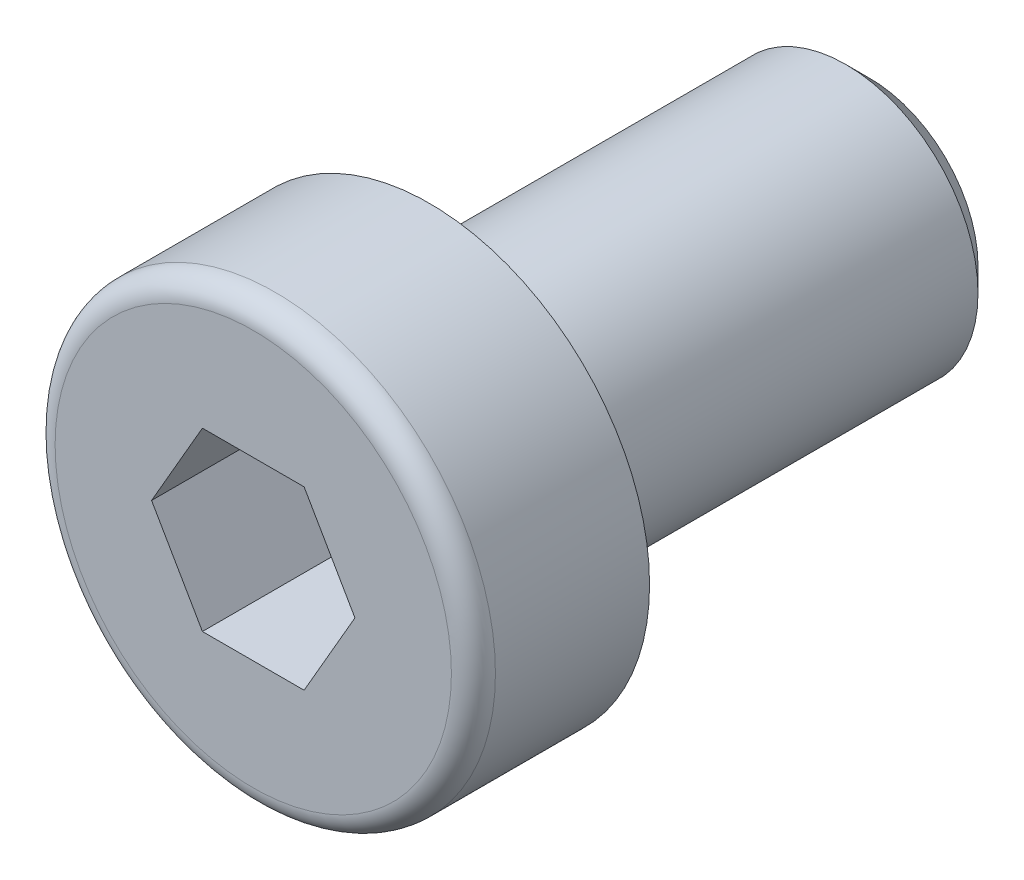
ISO-10303-21;
HEADER;
FILE_DESCRIPTION(('STEP AP214'),'2;1');
FILE_NAME('part.step','',(''),(''),'','','');
FILE_SCHEMA(('AUTOMOTIVE_DESIGN { 1 0 10303 214 1 1 1 1 }'));
ENDSEC;
DATA;
#1=APPLICATION_CONTEXT('core data for automotive mechanical design processes');
#2=APPLICATION_PROTOCOL_DEFINITION('international standard','automotive_design',2000,#1);
#3=PRODUCT_CONTEXT('',#1,'mechanical');
#4=PRODUCT('Part','Part','',(#3));
#5=PRODUCT_RELATED_PRODUCT_CATEGORY('part','',(#4));
#6=PRODUCT_DEFINITION_FORMATION('','',#4);
#7=PRODUCT_DEFINITION_CONTEXT('part definition',#1,'design');
#8=PRODUCT_DEFINITION('design','',#6,#7);
#9=PRODUCT_DEFINITION_SHAPE('','',#8);
#10=(LENGTH_UNIT() NAMED_UNIT(*) SI_UNIT(.MILLI.,.METRE.));
#11=(NAMED_UNIT(*) PLANE_ANGLE_UNIT() SI_UNIT($,.RADIAN.));
#12=(NAMED_UNIT(*) SI_UNIT($,.STERADIAN.) SOLID_ANGLE_UNIT());
#13=UNCERTAINTY_MEASURE_WITH_UNIT(LENGTH_MEASURE(1.E-05),#10,'distance_accuracy_value','');
#14=(GEOMETRIC_REPRESENTATION_CONTEXT(3) GLOBAL_UNCERTAINTY_ASSIGNED_CONTEXT((#13)) GLOBAL_UNIT_ASSIGNED_CONTEXT((#10,
#11,#12)) REPRESENTATION_CONTEXT('',''));
#15=CARTESIAN_POINT('',(0.,0.,0.));
#16=DIRECTION('',(0.,0.,1.));
#17=DIRECTION('',(1.,0.,0.));
#18=AXIS2_PLACEMENT_3D('',#15,#16,#17);
#19=CARTESIAN_POINT('',(0.,0.,4.));
#20=DIRECTION('',(0.,0.,1.));
#21=DIRECTION('',(1.,0.,0.));
#22=AXIS2_PLACEMENT_3D('',#19,#20,#21);
#23=CYLINDRICAL_SURFACE('',#22,3.);
#24=CARTESIAN_POINT('',(0.,0.,-0.3));
#25=DIRECTION('',(0.,0.,1.));
#26=DIRECTION('',(1.,0.,0.));
#27=AXIS2_PLACEMENT_3D('',#24,#25,#26);
#28=CIRCLE('',#27,3.);
#29=CARTESIAN_POINT('',(3.,0.,-0.3));
#30=VERTEX_POINT('',#29);
#31=EDGE_CURVE('E135',#30,#30,#28,.T.);
#32=ORIENTED_EDGE('',*,*,#31,.F.);
#33=EDGE_LOOP('',(#32));
#34=FACE_BOUND('',#33,.T.);
#35=CARTESIAN_POINT('',(0.,0.,-0.305));
#36=DIRECTION('',(0.,0.,1.));
#37=DIRECTION('',(1.,0.,0.));
#38=AXIS2_PLACEMENT_3D('',#35,#36,#37);
#39=CIRCLE('',#38,3.);
#40=CARTESIAN_POINT('',(3.,0.,-0.305));
#41=VERTEX_POINT('',#40);
#42=EDGE_CURVE('E284',#41,#41,#39,.T.);
#43=ORIENTED_EDGE('',*,*,#42,.T.);
#44=EDGE_LOOP('',(#43));
#45=FACE_BOUND('',#44,.T.);
#46=ADVANCED_FACE('F16',(#34,#45),#23,.T.);
#47=CARTESIAN_POINT('',(0.,0.,4.));
#48=DIRECTION('',(0.,0.,1.));
#49=DIRECTION('',(1.,0.,0.));
#50=AXIS2_PLACEMENT_3D('',#47,#48,#49);
#51=PLANE('',#50);
#52=CARTESIAN_POINT('',(0.,0.,4.));
#53=DIRECTION('',(0.,0.,1.));
#54=DIRECTION('',(1.,0.,0.));
#55=AXIS2_PLACEMENT_3D('',#52,#53,#54);
#56=CIRCLE('',#55,4.5);
#57=CARTESIAN_POINT('',(4.5,0.,4.));
#58=VERTEX_POINT('',#57);
#59=EDGE_CURVE('E119',#58,#58,#56,.T.);
#60=ORIENTED_EDGE('',*,*,#59,.T.);
#61=EDGE_LOOP('',(#60));
#62=FACE_BOUND('',#61,.T.);
#63=DIRECTION('',(1.,0.,0.));
#64=VECTOR('',#63,1.);
#65=CARTESIAN_POINT('',(-1.1547,1.99999906749978,4.));
#66=LINE('',#65,#64);
#67=CARTESIAN_POINT('',(-1.1547,1.99999906749978,4.));
#68=VERTEX_POINT('',#67);
#69=CARTESIAN_POINT('',(1.1547,1.99999906749978,4.));
#70=VERTEX_POINT('',#69);
#71=EDGE_CURVE('E96',#68,#70,#66,.T.);
#72=ORIENTED_EDGE('',*,*,#71,.T.);
#73=DIRECTION('',(0.5,-0.866025403784439,0.));
#74=VECTOR('',#73,1.);
#75=CARTESIAN_POINT('',(1.1547,1.99999906749978,4.));
#76=LINE('',#75,#74);
#77=CARTESIAN_POINT('',(2.3094,0.,4.));
#78=VERTEX_POINT('',#77);
#79=EDGE_CURVE('E32',#70,#78,#76,.T.);
#80=ORIENTED_EDGE('',*,*,#79,.T.);
#81=DIRECTION('',(-0.5,-0.866025403784439,0.));
#82=VECTOR('',#81,1.);
#83=CARTESIAN_POINT('',(2.3094,0.,4.));
#84=LINE('',#83,#82);
#85=CARTESIAN_POINT('',(1.1547,-1.99999906749978,4.));
#86=VERTEX_POINT('',#85);
#87=EDGE_CURVE('E200',#78,#86,#84,.T.);
#88=ORIENTED_EDGE('',*,*,#87,.T.);
#89=DIRECTION('',(-1.,0.,0.));
#90=VECTOR('',#89,1.);
#91=CARTESIAN_POINT('',(1.1547,-1.99999906749978,4.));
#92=LINE('',#91,#90);
#93=CARTESIAN_POINT('',(-1.1547,-1.99999906749978,4.));
#94=VERTEX_POINT('',#93);
#95=EDGE_CURVE('E259',#86,#94,#92,.T.);
#96=ORIENTED_EDGE('',*,*,#95,.T.);
#97=DIRECTION('',(-0.5,0.866025403784439,0.));
#98=VECTOR('',#97,1.);
#99=CARTESIAN_POINT('',(-1.1547,-1.99999906749978,4.));
#100=LINE('',#99,#98);
#101=CARTESIAN_POINT('',(-2.3094,0.,4.));
#102=VERTEX_POINT('',#101);
#103=EDGE_CURVE('E253',#94,#102,#100,.T.);
#104=ORIENTED_EDGE('',*,*,#103,.T.);
#105=DIRECTION('',(0.5,0.866025403784439,0.));
#106=VECTOR('',#105,1.);
#107=CARTESIAN_POINT('',(-2.3094,0.,4.));
#108=LINE('',#107,#106);
#109=EDGE_CURVE('E105',#102,#68,#108,.T.);
#110=ORIENTED_EDGE('',*,*,#109,.T.);
#111=EDGE_LOOP('',(#72,#80,#88,#96,#104,#110));
#112=FACE_BOUND('',#111,.T.);
#113=ADVANCED_FACE('F159',(#62,#112),#51,.T.);
#114=CARTESIAN_POINT('',(0.,0.,-0.3));
#115=DIRECTION('',(0.,0.,1.));
#116=DIRECTION('',(1.,0.,0.));
#117=AXIS2_PLACEMENT_3D('',#114,#115,#116);
#118=TOROIDAL_SURFACE('',#117,3.3,0.3);
#119=ORIENTED_EDGE('',*,*,#31,.T.);
#120=EDGE_LOOP('',(#119));
#121=FACE_BOUND('',#120,.T.);
#122=CARTESIAN_POINT('',(0.,0.,0.));
#123=DIRECTION('',(0.,0.,1.));
#124=DIRECTION('',(1.,0.,0.));
#125=AXIS2_PLACEMENT_3D('',#122,#123,#124);
#126=CIRCLE('',#125,3.3);
#127=CARTESIAN_POINT('',(3.3,0.,0.));
#128=VERTEX_POINT('',#127);
#129=EDGE_CURVE('E131',#128,#128,#126,.T.);
#130=ORIENTED_EDGE('',*,*,#129,.F.);
#131=EDGE_LOOP('',(#130));
#132=FACE_BOUND('',#131,.T.);
#133=ADVANCED_FACE('F164',(#121,#132),#118,.F.);
#134=CARTESIAN_POINT('',(0.,5.,0.));
#135=DIRECTION('',(0.,0.,-1.));
#136=DIRECTION('',(-1.,0.,0.));
#137=AXIS2_PLACEMENT_3D('',#134,#135,#136);
#138=PLANE('',#137);
#139=ORIENTED_EDGE('',*,*,#129,.T.);
#140=EDGE_LOOP('',(#139));
#141=FACE_BOUND('',#140,.T.);
#142=CARTESIAN_POINT('',(0.,0.,0.));
#143=DIRECTION('',(0.,0.,1.));
#144=DIRECTION('',(1.,0.,0.));
#145=AXIS2_PLACEMENT_3D('',#142,#143,#144);
#146=CIRCLE('',#145,5.);
#147=CARTESIAN_POINT('',(5.,0.,0.));
#148=VERTEX_POINT('',#147);
#149=EDGE_CURVE('E127',#148,#148,#146,.T.);
#150=ORIENTED_EDGE('',*,*,#149,.F.);
#151=EDGE_LOOP('',(#150));
#152=FACE_BOUND('',#151,.T.);
#153=ADVANCED_FACE('F172',(#141,#152),#138,.T.);
#154=CARTESIAN_POINT('',(0.,0.,4.));
#155=DIRECTION('',(0.,0.,1.));
#156=DIRECTION('',(1.,0.,0.));
#157=AXIS2_PLACEMENT_3D('',#154,#155,#156);
#158=CYLINDRICAL_SURFACE('',#157,5.);
#159=ORIENTED_EDGE('',*,*,#149,.T.);
#160=EDGE_LOOP('',(#159));
#161=FACE_BOUND('',#160,.T.);
#162=CARTESIAN_POINT('',(0.,0.,3.5));
#163=DIRECTION('',(0.,0.,1.));
#164=DIRECTION('',(1.,0.,0.));
#165=AXIS2_PLACEMENT_3D('',#162,#163,#164);
#166=CIRCLE('',#165,5.);
#167=CARTESIAN_POINT('',(5.,0.,3.5));
#168=VERTEX_POINT('',#167);
#169=EDGE_CURVE('E123',#168,#168,#166,.T.);
#170=ORIENTED_EDGE('',*,*,#169,.F.);
#171=EDGE_LOOP('',(#170));
#172=FACE_BOUND('',#171,.T.);
#173=ADVANCED_FACE('F176',(#161,#172),#158,.T.);
#174=CARTESIAN_POINT('',(0.,0.,3.5));
#175=DIRECTION('',(0.,0.,1.));
#176=DIRECTION('',(1.,0.,0.));
#177=AXIS2_PLACEMENT_3D('',#174,#175,#176);
#178=TOROIDAL_SURFACE('',#177,4.5,0.5);
#179=ORIENTED_EDGE('',*,*,#59,.F.);
#180=EDGE_LOOP('',(#179));
#181=FACE_BOUND('',#180,.T.);
#182=ORIENTED_EDGE('',*,*,#169,.T.);
#183=EDGE_LOOP('',(#182));
#184=FACE_BOUND('',#183,.T.);
#185=ADVANCED_FACE('F180',(#181,#184),#178,.T.);
#186=CARTESIAN_POINT('',(1.1547,1.99999906749978,-0.333332711666522));
#187=DIRECTION('',(-0.866025403784438,-0.5,0.));
#188=DIRECTION('',(-0.5,0.866025403784439,0.));
#189=AXIS2_PLACEMENT_3D('',#186,#187,#188);
#190=PLANE('',#189);
#191=DIRECTION('',(0.,0.,1.));
#192=VECTOR('',#191,1.);
#193=CARTESIAN_POINT('',(2.3094,0.,-0.333332711666522));
#194=LINE('',#193,#192);
#195=CARTESIAN_POINT('',(2.3094,0.,1.));
#196=VERTEX_POINT('',#195);
#197=EDGE_CURVE('E117',#196,#78,#194,.T.);
#198=ORIENTED_EDGE('',*,*,#197,.T.);
#199=ORIENTED_EDGE('',*,*,#79,.F.);
#200=DIRECTION('',(0.,0.,1.));
#201=VECTOR('',#200,1.);
#202=CARTESIAN_POINT('',(1.1547,1.99999906749978,-0.333332711666522));
#203=LINE('',#202,#201);
#204=CARTESIAN_POINT('',(1.1547,1.99999906749978,1.));
#205=VERTEX_POINT('',#204);
#206=EDGE_CURVE('E89',#205,#70,#203,.T.);
#207=ORIENTED_EDGE('',*,*,#206,.F.);
#208=CARTESIAN_POINT('',(2.30940115470054,-2.E-06,1.00000066666717));
#209=CARTESIAN_POINT('',(2.2586590633301,0.087885880335907,0.9706961706999));
#210=CARTESIAN_POINT('',(2.20747896699173,0.176532407530229,0.944045256937717));
#211=CARTESIAN_POINT('',(2.10423262359364,0.355360319991423,0.897526868213209));
#212=CARTESIAN_POINT('',(2.05216454263161,0.445544881670276,0.877675847930465));
#213=CARTESIAN_POINT('',(1.94867363491875,0.624796391950367,0.846776277435701));
#214=CARTESIAN_POINT('',(1.8972667271894,0.713835767997602,0.835522049923352));
#215=CARTESIAN_POINT('',(1.79421114915164,0.892333265162389,0.822089318026336));
#216=CARTESIAN_POINT('',(1.74256285316985,0.981790737927202,0.819899687557668));
#217=CARTESIAN_POINT('',(1.64606340062569,1.14893269263626,0.824466291009913));
#218=CARTESIAN_POINT('',(1.60119776416565,1.22664225449897,0.83010127235949));
#219=CARTESIAN_POINT('',(1.51175877649126,1.38155512532854,0.847957309601284));
#220=CARTESIAN_POINT('',(1.46718573439589,1.45875789888563,0.860184459220009));
#221=CARTESIAN_POINT('',(1.37756249119973,1.61398990964047,0.890749992357217));
#222=CARTESIAN_POINT('',(1.33252362751513,1.69199950985737,0.909217881832975));
#223=CARTESIAN_POINT('',(1.2431174638359,1.84685552785963,0.951132193219494));
#224=CARTESIAN_POINT('',(1.19874901931202,1.92370392802778,0.974568773138314));
#225=CARTESIAN_POINT('',(1.15469884529946,2.00000106749979,1.00000066666717));
#226=B_SPLINE_CURVE_WITH_KNOTS('',3,(#208,#209,#210,#211,#212,#213,#214,#215,#216,#217,#218,
#219,#220,#221,#222,#223,#224,#225),.UNSPECIFIED.,.F.,.F.,(4,2,2,2,2,2,2,2,4),(0.,
0.317016021868474,0.63479384162528,0.944707629264745,1.2542409089752,1.52370869907371,
1.79342601033586,2.06912439061208,2.34428168581533),.UNSPECIFIED.);
#227=EDGE_CURVE('E81',#196,#205,#226,.T.);
#228=ORIENTED_EDGE('',*,*,#227,.F.);
#229=EDGE_LOOP('',(#198,#199,#207,#228));
#230=FACE_BOUND('',#229,.T.);
#231=ADVANCED_FACE('F90',(#230),#190,.T.);
#232=CARTESIAN_POINT('',(2.3094,0.,-0.333332711666522));
#233=DIRECTION('',(-0.866025403784439,0.5,0.));
#234=DIRECTION('',(0.5,0.866025403784439,0.));
#235=AXIS2_PLACEMENT_3D('',#232,#233,#234);
#236=PLANE('',#235);
#237=DIRECTION('',(0.,0.,1.));
#238=VECTOR('',#237,1.);
#239=CARTESIAN_POINT('',(1.1547,-1.99999906749978,-0.333332711666522));
#240=LINE('',#239,#238);
#241=CARTESIAN_POINT('',(1.1547,-1.99999906749978,1.));
#242=VERTEX_POINT('',#241);
#243=EDGE_CURVE('E114',#242,#86,#240,.T.);
#244=ORIENTED_EDGE('',*,*,#243,.T.);
#245=ORIENTED_EDGE('',*,*,#87,.F.);
#246=ORIENTED_EDGE('',*,*,#197,.F.);
#247=CARTESIAN_POINT('',(1.15469884529946,-2.00000106749979,1.00000066666717));
#248=CARTESIAN_POINT('',(1.2054409366699,-1.91211318716388,0.970696170699899));
#249=CARTESIAN_POINT('',(1.25662103300827,-1.82346665996956,0.944045256937716));
#250=CARTESIAN_POINT('',(1.35986737640636,-1.64463874750836,0.897526868213209));
#251=CARTESIAN_POINT('',(1.41193545736839,-1.55445418582951,0.877675847930465));
#252=CARTESIAN_POINT('',(1.51542636508125,-1.37520267554942,0.8467762774357));
#253=CARTESIAN_POINT('',(1.5668332728106,-1.28616329950218,0.835522049923351));
#254=CARTESIAN_POINT('',(1.66988885084836,-1.10766580233739,0.822089318026335));
#255=CARTESIAN_POINT('',(1.72153714683015,-1.01820832957258,0.819899687557668));
#256=CARTESIAN_POINT('',(1.81803659937431,-0.851066374863522,0.824466291009913));
#257=CARTESIAN_POINT('',(1.86290223583435,-0.773356813000813,0.83010127235949));
#258=CARTESIAN_POINT('',(1.95234122350874,-0.618443942171244,0.847957309601284));
#259=CARTESIAN_POINT('',(1.99691426560411,-0.54124116861415,0.860184459220008));
#260=CARTESIAN_POINT('',(2.08653750880027,-0.386009157859311,0.890749992357216));
#261=CARTESIAN_POINT('',(2.13157637248487,-0.307999557642412,0.909217881832974));
#262=CARTESIAN_POINT('',(2.2209825361641,-0.153143539640156,0.951132193219494));
#263=CARTESIAN_POINT('',(2.26535098068798,-0.0762951394720063,0.974568773138314));
#264=CARTESIAN_POINT('',(2.30940115470054,1.9999999998888E-06,1.00000066666717));
#265=B_SPLINE_CURVE_WITH_KNOTS('',3,(#247,#248,#249,#250,#251,#252,#253,#254,#255,#256,#257,
#258,#259,#260,#261,#262,#263,#264),.UNSPECIFIED.,.F.,.F.,(4,2,2,2,2,2,2,2,4),(0.,
0.317016021868475,0.63479384162528,0.944707629264746,1.2542409089752,1.52370869907371,
1.79342601033586,2.06912439061208,2.34428168581532),.UNSPECIFIED.);
#266=EDGE_CURVE('E85',#242,#196,#265,.T.);
#267=ORIENTED_EDGE('',*,*,#266,.F.);
#268=EDGE_LOOP('',(#244,#245,#246,#267));
#269=FACE_BOUND('',#268,.T.);
#270=ADVANCED_FACE('F188',(#269),#236,.T.);
#271=CARTESIAN_POINT('',(1.1547,-1.99999906749978,-0.333332711666522));
#272=DIRECTION('',(0.,1.,0.));
#273=DIRECTION('',(1.,0.,0.));
#274=AXIS2_PLACEMENT_3D('',#271,#272,#273);
#275=PLANE('',#274);
#276=DIRECTION('',(0.,0.,1.));
#277=VECTOR('',#276,1.);
#278=CARTESIAN_POINT('',(-1.1547,-1.99999906749978,-0.333332711666522));
#279=LINE('',#278,#277);
#280=CARTESIAN_POINT('',(-1.1547,-1.99999906749978,1.));
#281=VERTEX_POINT('',#280);
#282=EDGE_CURVE('E111',#281,#94,#279,.T.);
#283=ORIENTED_EDGE('',*,*,#282,.T.);
#284=ORIENTED_EDGE('',*,*,#95,.F.);
#285=ORIENTED_EDGE('',*,*,#243,.F.);
#286=CARTESIAN_POINT('',(-2.99028884971983,-1.99999906749978,1.74367023125859));
#287=CARTESIAN_POINT('',(-2.90392200266685,-1.99999906749978,1.70223468621355));
#288=CARTESIAN_POINT('',(-2.81734475420192,-1.99999906749978,1.66122952382548));
#289=CARTESIAN_POINT('',(-2.64365731596042,-1.99999906749978,1.58032411328961));
#290=CARTESIAN_POINT('',(-2.55654703367194,-1.99999906749978,1.54042406398872));
#291=CARTESIAN_POINT('',(-2.38118192431167,-1.99999906749978,1.46175012614929));
#292=CARTESIAN_POINT('',(-2.29292335976907,-1.99999906749978,1.42298453713559));
#293=CARTESIAN_POINT('',(-2.11566562283863,-1.99999906749978,1.34719170485446));
#294=CARTESIAN_POINT('',(-2.02666648924309,-1.99999906749978,1.31016437120063));
#295=CARTESIAN_POINT('',(-1.84544164627787,-1.99999906749978,1.23736806072605));
#296=CARTESIAN_POINT('',(-1.75319241539257,-1.99999906749978,1.20165729625577));
#297=CARTESIAN_POINT('',(-1.56757813216983,-1.99999906749978,1.1332047864779));
#298=CARTESIAN_POINT('',(-1.47421295183128,-1.99999906749978,1.10046338553241));
#299=CARTESIAN_POINT('',(-1.28643386768821,-1.99999906749978,1.038885915786));
#300=CARTESIAN_POINT('',(-1.19202295783748,-1.99999906749978,1.01004081537766));
#301=CARTESIAN_POINT('',(-1.00184812907594,-1.99999906749978,0.957242344873184));
#302=CARTESIAN_POINT('',(-0.906084552528721,-1.99999906749978,0.933287759880673));
#303=CARTESIAN_POINT('',(-0.713403648485675,-1.99999906749978,0.891547504437826));
#304=CARTESIAN_POINT('',(-0.616489120401835,-1.99999906749978,0.873749163805324));
#305=CARTESIAN_POINT('',(-0.421576462996769,-1.99999906749978,0.845486027575821));
#306=CARTESIAN_POINT('',(-0.323578407356965,-1.99999906749978,0.835020736398733));
#307=CARTESIAN_POINT('',(-0.128212352021125,-1.99999906749978,0.822397765677674));
#308=CARTESIAN_POINT('',(-0.0308508716606807,-1.99999906749978,0.820142050335261));
#309=CARTESIAN_POINT('',(0.163710831550759,-1.99999906749978,0.82386608230561));
#310=CARTESIAN_POINT('',(0.260911044043611,-1.99999906749978,0.829846339556676));
#311=CARTESIAN_POINT('',(0.500738265811493,-1.99999906749979,0.854236866928713));
#312=CARTESIAN_POINT('',(0.642900579770635,-1.99999906749978,0.877218043731751));
#313=CARTESIAN_POINT('',(0.924460633233847,-1.99999906749978,0.936479804118712));
#314=CARTESIAN_POINT('',(1.06385482642399,-1.99999906749978,0.97277641667854));
#315=CARTESIAN_POINT('',(1.27233418248367,-1.99999906749978,1.03477991339468));
#316=CARTESIAN_POINT('',(1.3424969926884,-1.99999906749978,1.05699669002916));
#317=CARTESIAN_POINT('',(1.48209226240527,-1.99999906749978,1.10348542114602));
#318=CARTESIAN_POINT('',(1.55152514771462,-1.99999906749978,1.12775609303869));
#319=CARTESIAN_POINT('',(1.68975335664335,-1.99999906749978,1.17800013448867));
#320=CARTESIAN_POINT('',(1.75854879355,-1.99999906749978,1.20397319460621));
#321=CARTESIAN_POINT('',(1.89559758268158,-1.99999906749978,1.25734107185943));
#322=CARTESIAN_POINT('',(1.9638508410586,-1.99999906749978,1.28473612920681));
#323=CARTESIAN_POINT('',(2.13806940290074,-1.99999906749978,1.35641772846815));
#324=CARTESIAN_POINT('',(2.24368635497214,-1.99999906749978,1.401550016113));
#325=CARTESIAN_POINT('',(2.45396650508346,-1.99999906749978,1.49399021983251));
#326=CARTESIAN_POINT('',(2.55862963096903,-1.99999906749978,1.54129829888963));
#327=CARTESIAN_POINT('',(2.87150608038439,-1.99999906749978,1.68571923402663));
#328=CARTESIAN_POINT('',(3.0785715280017,-1.99999906749978,1.78531398238035));
#329=CARTESIAN_POINT('',(3.49093339473319,-1.99999906749978,1.98868046682796));
#330=CARTESIAN_POINT('',(3.69622732620256,-1.99999906749978,2.0924571873));
#331=CARTESIAN_POINT('',(4.10540863094205,-1.99999906749978,2.3026790674596));
#332=CARTESIAN_POINT('',(4.30929617883657,-1.99999906749978,2.40912388796881));
#333=CARTESIAN_POINT('',(4.69689964068717,-1.99999906749978,2.61371802640448));
#334=CARTESIAN_POINT('',(4.8807031106818,-1.99999906749978,2.71170204501137));
#335=CARTESIAN_POINT('',(5.24771880693925,-1.99999906749978,2.90878651474632));
#336=CARTESIAN_POINT('',(5.43093101099718,-1.99999906749978,3.00788700718989));
#337=CARTESIAN_POINT('',(5.79643447179695,-1.99999906749978,3.20667131714161));
#338=CARTESIAN_POINT('',(5.97872688569658,-1.99999906749978,3.30635300983316));
#339=CARTESIAN_POINT('',(6.34294316034774,-1.99999906749978,3.50636518212678));
#340=CARTESIAN_POINT('',(6.52486703988709,-1.99999906749978,3.60669562750369));
#341=CARTESIAN_POINT('',(6.70665851322056,-1.99999906749978,3.7072639721148));
#342=B_SPLINE_CURVE_WITH_KNOTS('',3,(#286,#287,#288,#289,#290,#291,#292,#293,#294,#295,#296,
#297,#298,#299,#300,#301,#302,#303,#304,#305,#306,#307,#308,#309,#310,#311,#312,#313,#314,#315,
#316,#317,#318,#319,#320,#321,#322,#323,#324,#325,#326,#327,#328,#329,#330,#331,#332,#333,#334,
#335,#336,#337,#338,#339,#340,#341),.UNSPECIFIED.,.F.,.F.,(4,2,2,2,2,2,2,2,2,2,2,2,2,2,2,2,2,2,
2,2,2,2,2,2,2,2,2,4),(0.,0.287380545294456,0.574812468409966,0.863987963789069,1.15314840582959,
1.44986914395045,1.74662424938927,2.04267922006207,2.33866055535835,2.63402905460955,
2.92937759042407,3.22118738911306,3.51301525630367,3.94415234632139,4.37581014668742,
4.59657452134229,4.81720203911729,5.03778956448221,5.25841447476324,5.60294646675355,
5.94750430884218,6.63673379533742,7.32681057136868,8.01680006289313,8.6416646832095,
9.26655250331282,9.88985091588627,10.513116710133),.UNSPECIFIED.);
#343=EDGE_CURVE('E228',#281,#242,#342,.T.);
#344=ORIENTED_EDGE('',*,*,#343,.F.);
#345=EDGE_LOOP('',(#283,#284,#285,#344));
#346=FACE_BOUND('',#345,.T.);
#347=ADVANCED_FACE('F233',(#346),#275,.T.);
#348=CARTESIAN_POINT('',(-1.1547,-1.99999906749978,-0.333332711666522));
#349=DIRECTION('',(0.866025403784439,0.5,0.));
#350=DIRECTION('',(0.5,-0.866025403784439,0.));
#351=AXIS2_PLACEMENT_3D('',#348,#349,#350);
#352=PLANE('',#351);
#353=DIRECTION('',(0.,0.,1.));
#354=VECTOR('',#353,1.);
#355=CARTESIAN_POINT('',(-2.3094,0.,-0.333332711666522));
#356=LINE('',#355,#354);
#357=CARTESIAN_POINT('',(-2.3094,0.,1.));
#358=VERTEX_POINT('',#357);
#359=EDGE_CURVE('E102',#358,#102,#356,.T.);
#360=ORIENTED_EDGE('',*,*,#359,.T.);
#361=ORIENTED_EDGE('',*,*,#103,.F.);
#362=ORIENTED_EDGE('',*,*,#282,.F.);
#363=CARTESIAN_POINT('',(-2.30940115470054,1.99999999944489E-06,1.00000066666717));
#364=CARTESIAN_POINT('',(-2.2586590633301,-0.0878858803359067,0.970696170699899));
#365=CARTESIAN_POINT('',(-2.20747896699173,-0.176532407530229,0.944045256937716));
#366=CARTESIAN_POINT('',(-2.10423262359364,-0.355360319991423,0.897526868213209));
#367=CARTESIAN_POINT('',(-2.05216454263161,-0.445544881670276,0.877675847930465));
#368=CARTESIAN_POINT('',(-1.94867363491875,-0.624796391950367,0.8467762774357));
#369=CARTESIAN_POINT('',(-1.8972667271894,-0.713835767997601,0.835522049923351));
#370=CARTESIAN_POINT('',(-1.79421114915164,-0.892333265162389,0.822089318026335));
#371=CARTESIAN_POINT('',(-1.74256285316985,-0.981790737927202,0.819899687557668));
#372=CARTESIAN_POINT('',(-1.64606340062569,-1.14893269263626,0.824466291009913));
#373=CARTESIAN_POINT('',(-1.60119776416565,-1.22664225449897,0.83010127235949));
#374=CARTESIAN_POINT('',(-1.51175877649126,-1.38155512532854,0.847957309601284));
#375=CARTESIAN_POINT('',(-1.46718573439589,-1.45875789888563,0.860184459220009));
#376=CARTESIAN_POINT('',(-1.37756249119973,-1.61398990964047,0.890749992357217));
#377=CARTESIAN_POINT('',(-1.33252362751513,-1.69199950985737,0.909217881832975));
#378=CARTESIAN_POINT('',(-1.2431174638359,-1.84685552785963,0.951132193219494));
#379=CARTESIAN_POINT('',(-1.19874901931202,-1.92370392802778,0.974568773138314));
#380=CARTESIAN_POINT('',(-1.15469884529946,-2.00000106749979,1.00000066666717));
#381=B_SPLINE_CURVE_WITH_KNOTS('',3,(#363,#364,#365,#366,#367,#368,#369,#370,#371,#372,#373,
#374,#375,#376,#377,#378,#379,#380),.UNSPECIFIED.,.F.,.F.,(4,2,2,2,2,2,2,2,4),(0.,
0.317016021868474,0.63479384162528,0.944707629264745,1.2542409089752,1.52370869907371,
1.79342601033586,2.06912439061208,2.34428168581533),.UNSPECIFIED.);
#382=EDGE_CURVE('E223',#358,#281,#381,.T.);
#383=ORIENTED_EDGE('',*,*,#382,.F.);
#384=EDGE_LOOP('',(#360,#361,#362,#383));
#385=FACE_BOUND('',#384,.T.);
#386=ADVANCED_FACE('F236',(#385),#352,.T.);
#387=CARTESIAN_POINT('',(-2.3094,0.,-0.333332711666522));
#388=DIRECTION('',(0.866025403784439,-0.5,0.));
#389=DIRECTION('',(-0.5,-0.866025403784439,0.));
#390=AXIS2_PLACEMENT_3D('',#387,#388,#389);
#391=PLANE('',#390);
#392=DIRECTION('',(0.,0.,1.));
#393=VECTOR('',#392,1.);
#394=CARTESIAN_POINT('',(-1.1547,1.99999906749978,-0.333332711666522));
#395=LINE('',#394,#393);
#396=CARTESIAN_POINT('',(-1.1547,1.99999906749978,1.));
#397=VERTEX_POINT('',#396);
#398=EDGE_CURVE('E95',#397,#68,#395,.T.);
#399=ORIENTED_EDGE('',*,*,#398,.T.);
#400=ORIENTED_EDGE('',*,*,#109,.F.);
#401=ORIENTED_EDGE('',*,*,#359,.F.);
#402=CARTESIAN_POINT('',(-1.15469884529946,2.00000106749979,1.00000066666717));
#403=CARTESIAN_POINT('',(-1.2054409366699,1.91211318716388,0.970696170699899));
#404=CARTESIAN_POINT('',(-1.25662103300827,1.82346665996956,0.944045256937717));
#405=CARTESIAN_POINT('',(-1.35986737640636,1.64463874750836,0.897526868213209));
#406=CARTESIAN_POINT('',(-1.41193545736839,1.55445418582951,0.877675847930465));
#407=CARTESIAN_POINT('',(-1.51542636508125,1.37520267554942,0.8467762774357));
#408=CARTESIAN_POINT('',(-1.5668332728106,1.28616329950218,0.835522049923351));
#409=CARTESIAN_POINT('',(-1.66988885084836,1.10766580233739,0.822089318026335));
#410=CARTESIAN_POINT('',(-1.72153714683015,1.01820832957258,0.819899687557668));
#411=CARTESIAN_POINT('',(-1.81803659937431,0.851066374863522,0.824466291009913));
#412=CARTESIAN_POINT('',(-1.86290223583435,0.773356813000812,0.830101272359489));
#413=CARTESIAN_POINT('',(-1.95234122350874,0.618443942171243,0.847957309601283));
#414=CARTESIAN_POINT('',(-1.99691426560411,0.541241168614149,0.860184459220008));
#415=CARTESIAN_POINT('',(-2.08653750880027,0.38600915785931,0.890749992357217));
#416=CARTESIAN_POINT('',(-2.13157637248487,0.307999557642411,0.909217881832974));
#417=CARTESIAN_POINT('',(-2.2209825361641,0.153143539640155,0.951132193219494));
#418=CARTESIAN_POINT('',(-2.26535098068798,0.0762951394720054,0.974568773138314));
#419=CARTESIAN_POINT('',(-2.30940115470054,-2.00000000062442E-06,1.00000066666717));
#420=B_SPLINE_CURVE_WITH_KNOTS('',3,(#402,#403,#404,#405,#406,#407,#408,#409,#410,#411,#412,
#413,#414,#415,#416,#417,#418,#419),.UNSPECIFIED.,.F.,.F.,(4,2,2,2,2,2,2,2,4),(0.,
0.317016021868475,0.634793841625281,0.944707629264746,1.2542409089752,1.52370869907371,
1.79342601033586,2.06912439061208,2.34428168581533),.UNSPECIFIED.);
#421=EDGE_CURVE('E40',#397,#358,#420,.T.);
#422=ORIENTED_EDGE('',*,*,#421,.F.);
#423=EDGE_LOOP('',(#399,#400,#401,#422));
#424=FACE_BOUND('',#423,.T.);
#425=ADVANCED_FACE('F240',(#424),#391,.T.);
#426=CARTESIAN_POINT('',(-1.1547,1.99999906749978,-0.333332711666522));
#427=DIRECTION('',(0.,-1.,0.));
#428=DIRECTION('',(-1.,0.,0.));
#429=AXIS2_PLACEMENT_3D('',#426,#427,#428);
#430=PLANE('',#429);
#431=ORIENTED_EDGE('',*,*,#206,.T.);
#432=ORIENTED_EDGE('',*,*,#71,.F.);
#433=ORIENTED_EDGE('',*,*,#398,.F.);
#434=CARTESIAN_POINT('',(-2.99028884971983,1.99999906749978,1.74367023125859));
#435=CARTESIAN_POINT('',(-2.90392200266685,1.99999906749978,1.70223468621355));
#436=CARTESIAN_POINT('',(-2.81734475420192,1.99999906749978,1.66122952382548));
#437=CARTESIAN_POINT('',(-2.64365731596042,1.99999906749978,1.58032411328961));
#438=CARTESIAN_POINT('',(-2.55654703367194,1.99999906749978,1.54042406398872));
#439=CARTESIAN_POINT('',(-2.38118192431167,1.99999906749978,1.46175012614929));
#440=CARTESIAN_POINT('',(-2.29292335976907,1.99999906749978,1.42298453713559));
#441=CARTESIAN_POINT('',(-2.11566562283863,1.99999906749978,1.34719170485446));
#442=CARTESIAN_POINT('',(-2.02666648924309,1.99999906749978,1.31016437120063));
#443=CARTESIAN_POINT('',(-1.84544164627787,1.99999906749978,1.23736806072605));
#444=CARTESIAN_POINT('',(-1.75319241539257,1.99999906749978,1.20165729625576));
#445=CARTESIAN_POINT('',(-1.56757813216984,1.99999906749978,1.1332047864779));
#446=CARTESIAN_POINT('',(-1.47421295183128,1.99999906749978,1.10046338553241));
#447=CARTESIAN_POINT('',(-1.28643386768822,1.99999906749978,1.038885915786));
#448=CARTESIAN_POINT('',(-1.19202295783749,1.99999906749978,1.01004081537766));
#449=CARTESIAN_POINT('',(-1.00184812907594,1.99999906749978,0.957242344873184));
#450=CARTESIAN_POINT('',(-0.906084552528723,1.99999906749978,0.933287759880674));
#451=CARTESIAN_POINT('',(-0.713403648485677,1.99999906749978,0.891547504437827));
#452=CARTESIAN_POINT('',(-0.616489120401838,1.99999906749978,0.873749163805324));
#453=CARTESIAN_POINT('',(-0.421576462996772,1.99999906749978,0.845486027575821));
#454=CARTESIAN_POINT('',(-0.323578407356967,1.99999906749978,0.835020736398734));
#455=CARTESIAN_POINT('',(-0.128212352021128,1.99999906749978,0.822397765677675));
#456=CARTESIAN_POINT('',(-0.0308508716606831,1.99999906749978,0.820142050335262));
#457=CARTESIAN_POINT('',(0.163710831550757,1.99999906749978,0.82386608230561));
#458=CARTESIAN_POINT('',(0.260911044043608,1.99999906749978,0.829846339556676));
#459=CARTESIAN_POINT('',(0.500738265811491,1.99999906749979,0.854236866928713));
#460=CARTESIAN_POINT('',(0.642900579770633,1.99999906749978,0.877218043731751));
#461=CARTESIAN_POINT('',(0.924460633233845,1.99999906749978,0.936479804118713));
#462=CARTESIAN_POINT('',(1.06385482642399,1.99999906749978,0.972776416678541));
#463=CARTESIAN_POINT('',(1.27233418248366,1.99999906749978,1.03477991339468));
#464=CARTESIAN_POINT('',(1.3424969926884,1.99999906749978,1.05699669002916));
#465=CARTESIAN_POINT('',(1.48209226240527,1.99999906749978,1.10348542114602));
#466=CARTESIAN_POINT('',(1.55152514771462,1.99999906749978,1.12775609303869));
#467=CARTESIAN_POINT('',(1.68975335664335,1.99999906749978,1.17800013448867));
#468=CARTESIAN_POINT('',(1.75854879355,1.99999906749978,1.20397319460621));
#469=CARTESIAN_POINT('',(1.89559758268158,1.99999906749978,1.25734107185943));
#470=CARTESIAN_POINT('',(1.9638508410586,1.99999906749978,1.28473612920681));
#471=CARTESIAN_POINT('',(2.13806940290074,1.99999906749979,1.35641772846815));
#472=CARTESIAN_POINT('',(2.24368635497214,1.99999906749978,1.401550016113));
#473=CARTESIAN_POINT('',(2.45396650508346,1.99999906749978,1.49399021983251));
#474=CARTESIAN_POINT('',(2.55862963096903,1.99999906749978,1.54129829888963));
#475=CARTESIAN_POINT('',(2.87150608038439,1.99999906749978,1.68571923402663));
#476=CARTESIAN_POINT('',(3.0785715280017,1.99999906749978,1.78531398238035));
#477=CARTESIAN_POINT('',(3.49093339473319,1.99999906749978,1.98868046682796));
#478=CARTESIAN_POINT('',(3.69622732620256,1.99999906749978,2.0924571873));
#479=CARTESIAN_POINT('',(4.10540863094205,1.99999906749978,2.30267906745961));
#480=CARTESIAN_POINT('',(4.30929617883657,1.99999906749978,2.40912388796881));
#481=CARTESIAN_POINT('',(4.69689964068717,1.99999906749978,2.61371802640448));
#482=CARTESIAN_POINT('',(4.8807031106818,1.99999906749978,2.71170204501137));
#483=CARTESIAN_POINT('',(5.24771880693925,1.99999906749978,2.90878651474632));
#484=CARTESIAN_POINT('',(5.43093101099718,1.99999906749978,3.00788700718989));
#485=CARTESIAN_POINT('',(5.79643447179695,1.99999906749978,3.20667131714161));
#486=CARTESIAN_POINT('',(5.97872688569658,1.99999906749978,3.30635300983316));
#487=CARTESIAN_POINT('',(6.34294316034774,1.99999906749978,3.50636518212678));
#488=CARTESIAN_POINT('',(6.52486703988709,1.99999906749978,3.60669562750369));
#489=CARTESIAN_POINT('',(6.70665851322056,1.99999906749978,3.7072639721148));
#490=B_SPLINE_CURVE_WITH_KNOTS('',3,(#434,#435,#436,#437,#438,#439,#440,#441,#442,#443,#444,
#445,#446,#447,#448,#449,#450,#451,#452,#453,#454,#455,#456,#457,#458,#459,#460,#461,#462,#463,
#464,#465,#466,#467,#468,#469,#470,#471,#472,#473,#474,#475,#476,#477,#478,#479,#480,#481,#482,
#483,#484,#485,#486,#487,#488,#489),.UNSPECIFIED.,.F.,.F.,(4,2,2,2,2,2,2,2,2,2,2,2,2,2,2,2,2,2,
2,2,2,2,2,2,2,2,2,4),(0.,0.287380545294456,0.574812468409967,0.863987963789069,1.15314840582959,
1.44986914395045,1.74662424938927,2.04267922006207,2.33866055535835,2.63402905460955,
2.92937759042407,3.22118738911306,3.51301525630367,3.94415234632138,4.37581014668742,
4.59657452134229,4.81720203911729,5.0377895644822,5.25841447476324,5.60294646675355,
5.94750430884218,6.63673379533742,7.32681057136868,8.01680006289313,8.6416646832095,
9.26655250331282,9.88985091588627,10.513116710133),.UNSPECIFIED.);
#491=EDGE_CURVE('E82',#205,#397,#490,.F.);
#492=ORIENTED_EDGE('',*,*,#491,.F.);
#493=EDGE_LOOP('',(#431,#432,#433,#492));
#494=FACE_BOUND('',#493,.T.);
#495=ADVANCED_FACE('F77',(#494),#430,.T.);
#496=CARTESIAN_POINT('',(0.,0.,-0.333332711666522));
#497=DIRECTION('',(0.,0.,1.));
#498=DIRECTION('',(1.,0.,0.));
#499=AXIS2_PLACEMENT_3D('',#496,#497,#498);
#500=CONICAL_SURFACE('',#499,0.,1.0471975511966);
#501=CARTESIAN_POINT('',(0.,0.,-0.333332711666522));
#502=VERTEX_POINT('',#501);
#503=VERTEX_LOOP('',#502);
#504=FACE_BOUND('',#503,.T.);
#505=ORIENTED_EDGE('',*,*,#227,.T.);
#506=ORIENTED_EDGE('',*,*,#491,.T.);
#507=ORIENTED_EDGE('',*,*,#421,.T.);
#508=ORIENTED_EDGE('',*,*,#382,.T.);
#509=ORIENTED_EDGE('',*,*,#343,.T.);
#510=ORIENTED_EDGE('',*,*,#266,.T.);
#511=EDGE_LOOP('',(#505,#506,#507,#508,#509,#510));
#512=FACE_BOUND('',#511,.T.);
#513=ADVANCED_FACE('F73',(#504,#512),#500,.F.);
#514=CARTESIAN_POINT('',(0.,0.,-0.305));
#515=DIRECTION('',(0.,0.,1.));
#516=DIRECTION('',(1.,0.,0.));
#517=AXIS2_PLACEMENT_3D('',#514,#515,#516);
#518=CONICAL_SURFACE('',#517,3.,0.523598775598299);
#519=CARTESIAN_POINT('',(0.,0.,-1.24247249959665));
#520=DIRECTION('',(0.,0.,1.));
#521=DIRECTION('',(1.,0.,0.));
#522=AXIS2_PLACEMENT_3D('',#519,#520,#521);
#523=CIRCLE('',#522,2.45875);
#524=CARTESIAN_POINT('',(2.45875,0.,-1.24247249959665));
#525=VERTEX_POINT('',#524);
#526=EDGE_CURVE('E287',#525,#525,#523,.T.);
#527=ORIENTED_EDGE('',*,*,#526,.T.);
#528=EDGE_LOOP('',(#527));
#529=FACE_BOUND('',#528,.T.);
#530=ORIENTED_EDGE('',*,*,#42,.F.);
#531=EDGE_LOOP('',(#530));
#532=FACE_BOUND('',#531,.T.);
#533=ADVANCED_FACE('F76',(#529,#532),#518,.T.);
#534=CARTESIAN_POINT('',(0.,2.45875,-1.24247249959665));
#535=DIRECTION('',(0.,0.,1.));
#536=DIRECTION('',(1.,0.,0.));
#537=AXIS2_PLACEMENT_3D('',#534,#535,#536);
#538=PLANE('',#537);
#539=CARTESIAN_POINT('',(0.,0.,-1.24247249959665));
#540=DIRECTION('',(0.,0.,1.));
#541=DIRECTION('',(1.,0.,0.));
#542=AXIS2_PLACEMENT_3D('',#539,#540,#541);
#543=CIRCLE('',#542,3.);
#544=CARTESIAN_POINT('',(3.,0.,-1.24247249959665));
#545=VERTEX_POINT('',#544);
#546=EDGE_CURVE('E453',#545,#545,#543,.T.);
#547=ORIENTED_EDGE('',*,*,#546,.T.);
#548=EDGE_LOOP('',(#547));
#549=FACE_BOUND('',#548,.T.);
#550=ORIENTED_EDGE('',*,*,#526,.F.);
#551=EDGE_LOOP('',(#550));
#552=FACE_BOUND('',#551,.T.);
#553=ADVANCED_FACE('F156',(#549,#552),#538,.T.);
#554=CARTESIAN_POINT('',(0.,2.45875,-10.));
#555=DIRECTION('',(0.,0.,-1.));
#556=DIRECTION('',(-1.,0.,0.));
#557=AXIS2_PLACEMENT_3D('',#554,#555,#556);
#558=PLANE('',#557);
#559=CARTESIAN_POINT('',(0.,0.,-10.));
#560=DIRECTION('',(0.,0.,1.));
#561=DIRECTION('',(1.,0.,0.));
#562=AXIS2_PLACEMENT_3D('',#559,#560,#561);
#563=CIRCLE('',#562,2.45875);
#564=CARTESIAN_POINT('',(2.45875,0.,-10.));
#565=VERTEX_POINT('',#564);
#566=EDGE_CURVE('E11',#565,#565,#563,.T.);
#567=ORIENTED_EDGE('',*,*,#566,.F.);
#568=EDGE_LOOP('',(#567));
#569=FACE_BOUND('',#568,.T.);
#570=ADVANCED_FACE('F18',(#569),#558,.T.);
#571=CARTESIAN_POINT('',(0.,0.,-9.45875));
#572=DIRECTION('',(0.,0.,1.));
#573=DIRECTION('',(1.,0.,0.));
#574=AXIS2_PLACEMENT_3D('',#571,#572,#573);
#575=CONICAL_SURFACE('',#574,3.,0.785398163397449);
#576=ORIENTED_EDGE('',*,*,#566,.T.);
#577=EDGE_LOOP('',(#576));
#578=FACE_BOUND('',#577,.T.);
#579=CARTESIAN_POINT('',(0.,0.,-9.45875));
#580=DIRECTION('',(0.,0.,1.));
#581=DIRECTION('',(1.,0.,0.));
#582=AXIS2_PLACEMENT_3D('',#579,#580,#581);
#583=CIRCLE('',#582,3.);
#584=CARTESIAN_POINT('',(3.,0.,-9.45875));
#585=VERTEX_POINT('',#584);
#586=EDGE_CURVE('E25',#585,#585,#583,.T.);
#587=ORIENTED_EDGE('',*,*,#586,.F.);
#588=EDGE_LOOP('',(#587));
#589=FACE_BOUND('',#588,.T.);
#590=ADVANCED_FACE('F147',(#578,#589),#575,.T.);
#591=ORIENTED_EDGE('',*,*,#586,.T.);
#592=EDGE_LOOP('',(#591));
#593=FACE_BOUND('',#592,.T.);
#594=ORIENTED_EDGE('',*,*,#546,.F.);
#595=EDGE_LOOP('',(#594));
#596=FACE_BOUND('',#595,.T.);
#597=ADVANCED_FACE('F144',(#593,#596),#23,.T.);
#598=CLOSED_SHELL('',(#46,#113,#133,#153,#173,#185,#231,#270,#347,#386,#425,#495,#513,#533,#553,
#570,#590,#597));
#599=MANIFOLD_SOLID_BREP('B1',#598);
#600=ADVANCED_BREP_SHAPE_REPRESENTATION('',(#18,#599),#14);
#601=SHAPE_DEFINITION_REPRESENTATION(#9,#600);
ENDSEC;
END-ISO-10303-21;
